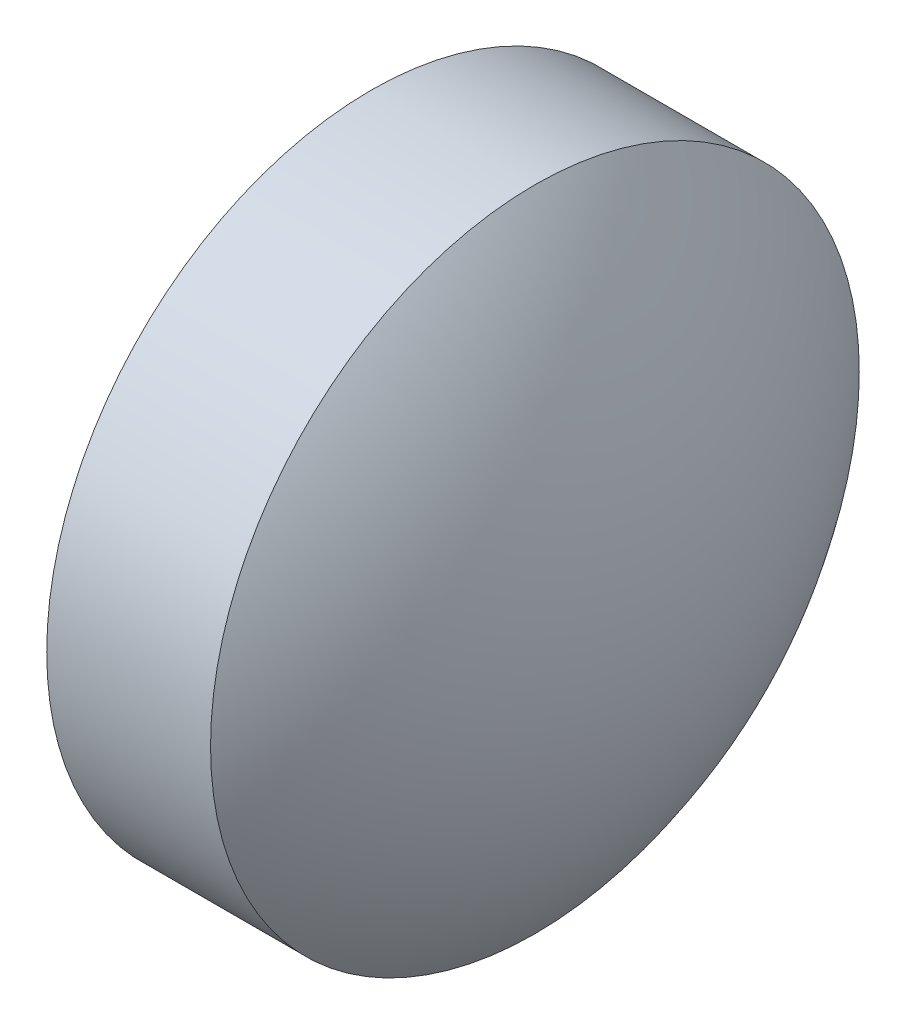
ISO-10303-21;
HEADER;
FILE_DESCRIPTION(('STEP AP214'),'2;1');
FILE_NAME('part.step','',(''),(''),'','','');
FILE_SCHEMA(('AUTOMOTIVE_DESIGN { 1 0 10303 214 1 1 1 1 }'));
ENDSEC;
DATA;
#1=APPLICATION_CONTEXT('core data for automotive mechanical design processes');
#2=APPLICATION_PROTOCOL_DEFINITION('international standard','automotive_design',2000,#1);
#3=PRODUCT_CONTEXT('',#1,'mechanical');
#4=PRODUCT('Part','Part','',(#3));
#5=PRODUCT_RELATED_PRODUCT_CATEGORY('part','',(#4));
#6=PRODUCT_DEFINITION_FORMATION('','',#4);
#7=PRODUCT_DEFINITION_CONTEXT('part definition',#1,'design');
#8=PRODUCT_DEFINITION('design','',#6,#7);
#9=PRODUCT_DEFINITION_SHAPE('','',#8);
#10=(LENGTH_UNIT() NAMED_UNIT(*) SI_UNIT(.MILLI.,.METRE.));
#11=(NAMED_UNIT(*) PLANE_ANGLE_UNIT() SI_UNIT($,.RADIAN.));
#12=(NAMED_UNIT(*) SI_UNIT($,.STERADIAN.) SOLID_ANGLE_UNIT());
#13=UNCERTAINTY_MEASURE_WITH_UNIT(LENGTH_MEASURE(1.E-05),#10,'distance_accuracy_value','');
#14=(GEOMETRIC_REPRESENTATION_CONTEXT(3) GLOBAL_UNCERTAINTY_ASSIGNED_CONTEXT((#13)) GLOBAL_UNIT_ASSIGNED_CONTEXT((#10,
#11,#12)) REPRESENTATION_CONTEXT('',''));
#15=CARTESIAN_POINT('',(0.,0.,0.));
#16=DIRECTION('',(0.,0.,1.));
#17=DIRECTION('',(1.,0.,0.));
#18=AXIS2_PLACEMENT_3D('',#15,#16,#17);
#19=CARTESIAN_POINT('',(525.901260588373,148.13076894015,0.));
#20=DIRECTION('',(-1.,0.,0.));
#21=DIRECTION('',(0.,0.,1.));
#22=AXIS2_PLACEMENT_3D('',#19,#20,#21);
#23=CYLINDRICAL_SURFACE('',#22,2.);
#24=CARTESIAN_POINT('',(526.531233026742,148.13076894015,0.));
#25=DIRECTION('',(-1.,0.,0.));
#26=DIRECTION('',(0.,0.,1.));
#27=AXIS2_PLACEMENT_3D('',#24,#25,#26);
#28=CIRCLE('',#27,2.);
#29=CARTESIAN_POINT('',(526.531233026742,148.13076894015,2.));
#30=VERTEX_POINT('',#29);
#31=EDGE_CURVE('E10',#30,#30,#28,.T.);
#32=ORIENTED_EDGE('',*,*,#31,.F.);
#33=EDGE_LOOP('',(#32));
#34=FACE_BOUND('',#33,.T.);
#35=CARTESIAN_POINT('',(527.541233026742,148.13076894015,0.));
#36=DIRECTION('',(-1.,0.,0.));
#37=DIRECTION('',(0.,0.,1.));
#38=AXIS2_PLACEMENT_3D('',#35,#36,#37);
#39=CIRCLE('',#38,2.);
#40=CARTESIAN_POINT('',(527.541233026742,148.13076894015,2.));
#41=VERTEX_POINT('',#40);
#42=EDGE_CURVE('E41',#41,#41,#39,.T.);
#43=ORIENTED_EDGE('',*,*,#42,.T.);
#44=EDGE_LOOP('',(#43));
#45=FACE_BOUND('',#44,.T.);
#46=ADVANCED_FACE('F35',(#34,#45),#23,.T.);
#47=CARTESIAN_POINT('',(526.531233026742,150.13076894015,0.));
#48=DIRECTION('',(1.,0.,0.));
#49=DIRECTION('',(0.,0.,-1.));
#50=AXIS2_PLACEMENT_3D('',#47,#48,#49);
#51=PLANE('',#50);
#52=ORIENTED_EDGE('',*,*,#31,.T.);
#53=EDGE_LOOP('',(#52));
#54=FACE_BOUND('',#53,.T.);
#55=ADVANCED_FACE('F50',(#54),#51,.F.);
#56=CARTESIAN_POINT('',(524.987682302105,148.13076894015,0.));
#57=DIRECTION('',(-1.,0.,0.));
#58=DIRECTION('',(0.,1.,0.));
#59=AXIS2_PLACEMENT_3D('',#56,#57,#58);
#60=SPHERICAL_SURFACE('',#59,3.24355072463766);
#61=ORIENTED_EDGE('',*,*,#42,.F.);
#62=EDGE_LOOP('',(#61));
#63=FACE_BOUND('',#62,.T.);
#64=ADVANCED_FACE('F48',(#63),#60,.T.);
#65=CLOSED_SHELL('',(#46,#55,#64));
#66=MANIFOLD_SOLID_BREP('B2',#65);
#67=ADVANCED_BREP_SHAPE_REPRESENTATION('',(#18,#66),#14);
#68=SHAPE_DEFINITION_REPRESENTATION(#9,#67);
ENDSEC;
END-ISO-10303-21;
